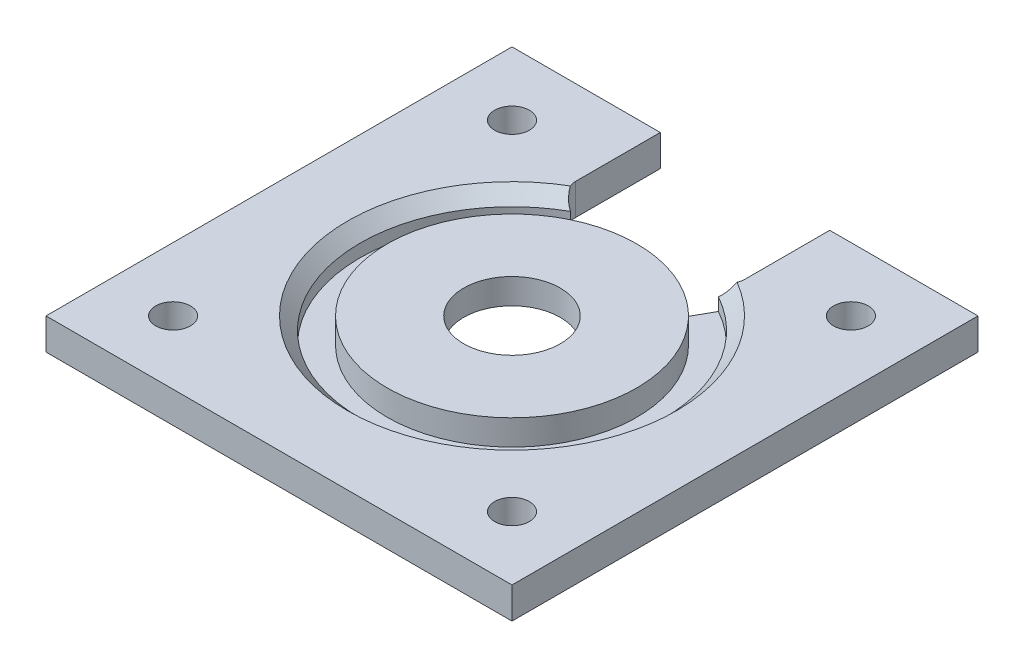
ISO-10303-21;
HEADER;
FILE_DESCRIPTION(('STEP AP214'),'2;1');
FILE_NAME('part.step','',(''),(''),'','','');
FILE_SCHEMA(('AUTOMOTIVE_DESIGN { 1 0 10303 214 1 1 1 1 }'));
ENDSEC;
DATA;
#1=APPLICATION_CONTEXT('core data for automotive mechanical design processes');
#2=APPLICATION_PROTOCOL_DEFINITION('international standard','automotive_design',2000,#1);
#3=PRODUCT_CONTEXT('',#1,'mechanical');
#4=PRODUCT('Part','Part','',(#3));
#5=PRODUCT_RELATED_PRODUCT_CATEGORY('part','',(#4));
#6=PRODUCT_DEFINITION_FORMATION('','',#4);
#7=PRODUCT_DEFINITION_CONTEXT('part definition',#1,'design');
#8=PRODUCT_DEFINITION('design','',#6,#7);
#9=PRODUCT_DEFINITION_SHAPE('','',#8);
#10=(LENGTH_UNIT() NAMED_UNIT(*) SI_UNIT(.MILLI.,.METRE.));
#11=(NAMED_UNIT(*) PLANE_ANGLE_UNIT() SI_UNIT($,.RADIAN.));
#12=(NAMED_UNIT(*) SI_UNIT($,.STERADIAN.) SOLID_ANGLE_UNIT());
#13=UNCERTAINTY_MEASURE_WITH_UNIT(LENGTH_MEASURE(1.E-05),#10,'distance_accuracy_value','');
#14=(GEOMETRIC_REPRESENTATION_CONTEXT(3) GLOBAL_UNCERTAINTY_ASSIGNED_CONTEXT((#13)) GLOBAL_UNIT_ASSIGNED_CONTEXT((#10,
#11,#12)) REPRESENTATION_CONTEXT('',''));
#15=CARTESIAN_POINT('',(0.,0.,0.));
#16=DIRECTION('',(0.,0.,1.));
#17=DIRECTION('',(1.,0.,0.));
#18=AXIS2_PLACEMENT_3D('',#15,#16,#17);
#19=CARTESIAN_POINT('',(5.8,-0.7,0.));
#20=DIRECTION('',(0.,-1.,0.));
#21=DIRECTION('',(0.,0.,-1.));
#22=AXIS2_PLACEMENT_3D('',#19,#20,#21);
#23=PLANE('',#22);
#24=CARTESIAN_POINT('',(-5.7,-0.7,0.));
#25=DIRECTION('',(0.,-1.,0.));
#26=DIRECTION('',(0.,0.,-1.));
#27=AXIS2_PLACEMENT_3D('',#24,#25,#26);
#28=CIRCLE('',#27,11.5);
#29=CARTESIAN_POINT('',(-5.7,-0.7,-11.5));
#30=VERTEX_POINT('',#29);
#31=EDGE_CURVE('E257',#30,#30,#28,.T.);
#32=ORIENTED_EDGE('',*,*,#31,.F.);
#33=EDGE_LOOP('',(#32));
#34=FACE_BOUND('',#33,.T.);
#35=CARTESIAN_POINT('',(14.3,-0.7,-20.));
#36=DIRECTION('',(0.,-1.,0.));
#37=DIRECTION('',(0.,0.,-1.));
#38=AXIS2_PLACEMENT_3D('',#35,#36,#37);
#39=CIRCLE('',#38,2.05);
#40=CARTESIAN_POINT('',(14.3,-0.7,-22.05));
#41=VERTEX_POINT('',#40);
#42=EDGE_CURVE('E204',#41,#41,#39,.T.);
#43=ORIENTED_EDGE('',*,*,#42,.F.);
#44=EDGE_LOOP('',(#43));
#45=FACE_BOUND('',#44,.T.);
#46=CARTESIAN_POINT('',(-25.7,-0.7,-20.));
#47=DIRECTION('',(0.,-1.,0.));
#48=DIRECTION('',(0.,0.,-1.));
#49=AXIS2_PLACEMENT_3D('',#46,#47,#48);
#50=CIRCLE('',#49,2.05);
#51=CARTESIAN_POINT('',(-25.7,-0.7,-22.05));
#52=VERTEX_POINT('',#51);
#53=EDGE_CURVE('E207',#52,#52,#50,.T.);
#54=ORIENTED_EDGE('',*,*,#53,.F.);
#55=EDGE_LOOP('',(#54));
#56=FACE_BOUND('',#55,.T.);
#57=CARTESIAN_POINT('',(-25.7,-0.7,20.));
#58=DIRECTION('',(0.,-1.,0.));
#59=DIRECTION('',(0.,0.,-1.));
#60=AXIS2_PLACEMENT_3D('',#57,#58,#59);
#61=CIRCLE('',#60,2.05);
#62=CARTESIAN_POINT('',(-25.7,-0.7,17.95));
#63=VERTEX_POINT('',#62);
#64=EDGE_CURVE('E210',#63,#63,#61,.T.);
#65=ORIENTED_EDGE('',*,*,#64,.F.);
#66=EDGE_LOOP('',(#65));
#67=FACE_BOUND('',#66,.T.);
#68=CARTESIAN_POINT('',(14.3,-0.7,20.));
#69=DIRECTION('',(0.,-1.,0.));
#70=DIRECTION('',(0.,0.,-1.));
#71=AXIS2_PLACEMENT_3D('',#68,#69,#70);
#72=CIRCLE('',#71,2.05);
#73=CARTESIAN_POINT('',(14.3,-0.7,17.95));
#74=VERTEX_POINT('',#73);
#75=EDGE_CURVE('E213',#74,#74,#72,.T.);
#76=ORIENTED_EDGE('',*,*,#75,.F.);
#77=EDGE_LOOP('',(#76));
#78=FACE_BOUND('',#77,.T.);
#79=DIRECTION('',(0.487252339671173,0.,-0.87326121950134));
#80=VECTOR('',#79,1.);
#81=CARTESIAN_POINT('',(1.47722696335638,-0.699999999999999,-12.8631377632547));
#82=LINE('',#81,#80);
#83=CARTESIAN_POINT('',(1.47722696335638,-0.699999999999999,-12.8631377632547));
#84=VERTEX_POINT('',#83);
#85=CARTESIAN_POINT('',(3.02425314181235,-0.699999999999999,-15.6357421351715));
#86=VERTEX_POINT('',#85);
#87=EDGE_CURVE('E151',#84,#86,#82,.T.);
#88=ORIENTED_EDGE('',*,*,#87,.T.);
#89=CARTESIAN_POINT('',(2.3,-0.699999999999999,-17.5));
#90=DIRECTION('',(0.,-1.,0.));
#91=DIRECTION('',(0.,0.,-1.));
#92=AXIS2_PLACEMENT_3D('',#89,#90,#91);
#93=CIRCLE('',#92,2.);
#94=CARTESIAN_POINT('',(4.3,-0.699999999999999,-17.5));
#95=VERTEX_POINT('',#94);
#96=EDGE_CURVE('E159',#86,#95,#93,.F.);
#97=ORIENTED_EDGE('',*,*,#96,.T.);
#98=DIRECTION('',(0.,0.,-1.));
#99=VECTOR('',#98,1.);
#100=CARTESIAN_POINT('',(4.3,-0.699999999999999,-17.5));
#101=LINE('',#100,#99);
#102=CARTESIAN_POINT('',(4.3,-0.699999999999999,-27.5));
#103=VERTEX_POINT('',#102);
#104=EDGE_CURVE('E176',#95,#103,#101,.T.);
#105=ORIENTED_EDGE('',*,*,#104,.T.);
#106=DIRECTION('',(-1.,0.,0.));
#107=VECTOR('',#106,1.);
#108=CARTESIAN_POINT('',(-33.2,-0.700000000000006,-27.5));
#109=LINE('',#108,#107);
#110=CARTESIAN_POINT('',(21.8,-0.700000000000006,-27.5));
#111=VERTEX_POINT('',#110);
#112=EDGE_CURVE('E71',#111,#103,#109,.T.);
#113=ORIENTED_EDGE('',*,*,#112,.F.);
#114=DIRECTION('',(0.,0.,-1.));
#115=VECTOR('',#114,1.);
#116=CARTESIAN_POINT('',(21.8,-0.700000000000006,-27.5));
#117=LINE('',#116,#115);
#118=CARTESIAN_POINT('',(21.8,-0.700000000000006,27.5));
#119=VERTEX_POINT('',#118);
#120=EDGE_CURVE('E229',#119,#111,#117,.T.);
#121=ORIENTED_EDGE('',*,*,#120,.F.);
#122=DIRECTION('',(1.,0.,0.));
#123=VECTOR('',#122,1.);
#124=CARTESIAN_POINT('',(-33.2,-0.700000000000006,27.5));
#125=LINE('',#124,#123);
#126=CARTESIAN_POINT('',(-33.2,-0.700000000000006,27.5));
#127=VERTEX_POINT('',#126);
#128=EDGE_CURVE('E235',#127,#119,#125,.T.);
#129=ORIENTED_EDGE('',*,*,#128,.F.);
#130=DIRECTION('',(0.,0.,1.));
#131=VECTOR('',#130,1.);
#132=CARTESIAN_POINT('',(-33.2,-0.700000000000006,-27.5));
#133=LINE('',#132,#131);
#134=CARTESIAN_POINT('',(-33.2,-0.700000000000006,-27.5));
#135=VERTEX_POINT('',#134);
#136=EDGE_CURVE('E239',#135,#127,#133,.T.);
#137=ORIENTED_EDGE('',*,*,#136,.F.);
#138=CARTESIAN_POINT('',(-15.7,-0.699999999999999,-27.5));
#139=VERTEX_POINT('',#138);
#140=EDGE_CURVE('E232',#139,#135,#109,.T.);
#141=ORIENTED_EDGE('',*,*,#140,.F.);
#142=DIRECTION('',(0.,0.,1.));
#143=VECTOR('',#142,1.);
#144=CARTESIAN_POINT('',(-15.7,-0.699999999999999,-17.5));
#145=LINE('',#144,#143);
#146=CARTESIAN_POINT('',(-15.7,-0.699999999999999,-17.5));
#147=VERTEX_POINT('',#146);
#148=EDGE_CURVE('E179',#139,#147,#145,.T.);
#149=ORIENTED_EDGE('',*,*,#148,.T.);
#150=CARTESIAN_POINT('',(-13.7,-0.699999999999999,-17.5));
#151=DIRECTION('',(0.,-1.,0.));
#152=DIRECTION('',(0.,0.,-1.));
#153=AXIS2_PLACEMENT_3D('',#150,#151,#152);
#154=CIRCLE('',#153,2.);
#155=CARTESIAN_POINT('',(-14.4242531418124,-0.699999999999999,-15.6357421351715));
#156=VERTEX_POINT('',#155);
#157=EDGE_CURVE('E169',#147,#156,#154,.F.);
#158=ORIENTED_EDGE('',*,*,#157,.T.);
#159=DIRECTION('',(0.487252339671173,0.,0.87326121950134));
#160=VECTOR('',#159,1.);
#161=CARTESIAN_POINT('',(-14.4242531418124,-0.699999999999999,-15.6357421351715));
#162=LINE('',#161,#160);
#163=CARTESIAN_POINT('',(-12.8772269633564,-0.699999999999999,-12.8631377632547));
#164=VERTEX_POINT('',#163);
#165=EDGE_CURVE('E381',#156,#164,#162,.T.);
#166=ORIENTED_EDGE('',*,*,#165,.T.);
#167=CARTESIAN_POINT('',(-5.7,-0.699999999999999,0.));
#168=DIRECTION('',(0.,-1.,0.));
#169=DIRECTION('',(0.,0.,-1.));
#170=AXIS2_PLACEMENT_3D('',#167,#168,#169);
#171=CIRCLE('',#170,14.73);
#172=EDGE_CURVE('E162',#164,#84,#171,.T.);
#173=ORIENTED_EDGE('',*,*,#172,.T.);
#174=EDGE_LOOP('',(#88,#97,#105,#113,#121,#129,#137,#141,#149,#158,#166,#173));
#175=FACE_BOUND('',#174,.T.);
#176=ADVANCED_FACE('F41',(#34,#45,#56,#67,#78,#175),#23,.T.);
#177=CARTESIAN_POINT('',(-33.2,-78.4817459305202,-27.5));
#178=DIRECTION('',(0.,0.,-1.));
#179=DIRECTION('',(-1.,0.,0.));
#180=AXIS2_PLACEMENT_3D('',#177,#178,#179);
#181=PLANE('',#180);
#182=DIRECTION('',(0.,1.,0.));
#183=VECTOR('',#182,1.);
#184=CARTESIAN_POINT('',(4.3,-24.0238075793812,-27.5));
#185=LINE('',#184,#183);
#186=CARTESIAN_POINT('',(4.3,3.,-27.5));
#187=VERTEX_POINT('',#186);
#188=EDGE_CURVE('E185',#103,#187,#185,.T.);
#189=ORIENTED_EDGE('',*,*,#188,.T.);
#190=DIRECTION('',(-1.,0.,0.));
#191=VECTOR('',#190,1.);
#192=CARTESIAN_POINT('',(-33.2,3.,-27.5));
#193=LINE('',#192,#191);
#194=CARTESIAN_POINT('',(21.8,3.,-27.5));
#195=VERTEX_POINT('',#194);
#196=EDGE_CURVE('E223',#195,#187,#193,.T.);
#197=ORIENTED_EDGE('',*,*,#196,.F.);
#198=DIRECTION('',(0.,1.,0.));
#199=VECTOR('',#198,1.);
#200=CARTESIAN_POINT('',(21.8,-78.4817459305202,-27.5));
#201=LINE('',#200,#199);
#202=EDGE_CURVE('E234',#111,#195,#201,.T.);
#203=ORIENTED_EDGE('',*,*,#202,.F.);
#204=ORIENTED_EDGE('',*,*,#112,.T.);
#205=EDGE_LOOP('',(#189,#197,#203,#204));
#206=FACE_BOUND('',#205,.T.);
#207=ADVANCED_FACE('F325',(#206),#181,.T.);
#208=CARTESIAN_POINT('',(19.7672047434114,0.,0.));
#209=DIRECTION('',(0.,1.,0.));
#210=DIRECTION('',(0.,0.,1.));
#211=AXIS2_PLACEMENT_3D('',#208,#209,#210);
#212=PLANE('',#211);
#213=DIRECTION('',(0.487252339671173,0.,-0.87326121950134));
#214=VECTOR('',#213,1.);
#215=CARTESIAN_POINT('',(1.47722696335638,0.,-12.8631377632547));
#216=LINE('',#215,#214);
#217=CARTESIAN_POINT('',(1.47722696335638,0.,-12.8631377632547));
#218=VERTEX_POINT('',#217);
#219=CARTESIAN_POINT('',(3.02425314181235,0.,-15.6357421351715));
#220=VERTEX_POINT('',#219);
#221=EDGE_CURVE('E154',#218,#220,#216,.T.);
#222=ORIENTED_EDGE('',*,*,#221,.F.);
#223=CARTESIAN_POINT('',(-5.7,0.,0.));
#224=DIRECTION('',(0.,-1.,0.));
#225=DIRECTION('',(0.,0.,-1.));
#226=AXIS2_PLACEMENT_3D('',#223,#224,#225);
#227=CIRCLE('',#226,14.73);
#228=CARTESIAN_POINT('',(-12.8772269633564,0.,-12.8631377632547));
#229=VERTEX_POINT('',#228);
#230=EDGE_CURVE('E254',#218,#229,#227,.T.);
#231=ORIENTED_EDGE('',*,*,#230,.T.);
#232=DIRECTION('',(0.487252339671173,0.,0.87326121950134));
#233=VECTOR('',#232,1.);
#234=CARTESIAN_POINT('',(-14.4242531418124,0.,-15.6357421351715));
#235=LINE('',#234,#233);
#236=CARTESIAN_POINT('',(-14.4242531418124,0.,-15.6357421351715));
#237=VERTEX_POINT('',#236);
#238=EDGE_CURVE('E163',#237,#229,#235,.T.);
#239=ORIENTED_EDGE('',*,*,#238,.F.);
#240=CARTESIAN_POINT('',(-5.7,0.,0.));
#241=DIRECTION('',(0.,1.,0.));
#242=DIRECTION('',(0.,0.,1.));
#243=AXIS2_PLACEMENT_3D('',#240,#241,#242);
#244=CIRCLE('',#243,17.905);
#245=EDGE_CURVE('E266',#220,#237,#244,.F.);
#246=ORIENTED_EDGE('',*,*,#245,.F.);
#247=EDGE_LOOP('',(#222,#231,#239,#246));
#248=FACE_BOUND('',#247,.T.);
#249=ADVANCED_FACE('F346',(#248),#212,.T.);
#250=CARTESIAN_POINT('',(-5.7,-3.54929577464788,0.));
#251=DIRECTION('',(0.,-1.,0.));
#252=DIRECTION('',(0.,0.,-1.));
#253=AXIS2_PLACEMENT_3D('',#250,#251,#252);
#254=CYLINDRICAL_SURFACE('',#253,5.7);
#255=CARTESIAN_POINT('',(-5.7,0.,0.));
#256=DIRECTION('',(0.,-1.,0.));
#257=DIRECTION('',(0.,0.,-1.));
#258=AXIS2_PLACEMENT_3D('',#255,#256,#257);
#259=CIRCLE('',#258,5.7);
#260=CARTESIAN_POINT('',(-5.7,0.,-5.7));
#261=VERTEX_POINT('',#260);
#262=EDGE_CURVE('E263',#261,#261,#259,.T.);
#263=ORIENTED_EDGE('',*,*,#262,.T.);
#264=EDGE_LOOP('',(#263));
#265=FACE_BOUND('',#264,.T.);
#266=CARTESIAN_POINT('',(-5.7,3.,0.));
#267=DIRECTION('',(0.,-1.,0.));
#268=DIRECTION('',(0.,0.,-1.));
#269=AXIS2_PLACEMENT_3D('',#266,#267,#268);
#270=CIRCLE('',#269,5.7);
#271=CARTESIAN_POINT('',(-5.7,3.,-5.7));
#272=VERTEX_POINT('',#271);
#273=EDGE_CURVE('E247',#272,#272,#270,.T.);
#274=ORIENTED_EDGE('',*,*,#273,.F.);
#275=EDGE_LOOP('',(#274));
#276=FACE_BOUND('',#275,.T.);
#277=ADVANCED_FACE('F349',(#265,#276),#254,.F.);
#278=CARTESIAN_POINT('',(0.,0.,0.));
#279=DIRECTION('',(0.,-1.,0.));
#280=DIRECTION('',(0.,0.,-1.));
#281=AXIS2_PLACEMENT_3D('',#278,#279,#280);
#282=PLANE('',#281);
#283=CARTESIAN_POINT('',(-5.7,0.,0.));
#284=DIRECTION('',(0.,-1.,0.));
#285=DIRECTION('',(0.,0.,-1.));
#286=AXIS2_PLACEMENT_3D('',#283,#284,#285);
#287=CIRCLE('',#286,11.5);
#288=CARTESIAN_POINT('',(-5.7,0.,-11.5));
#289=VERTEX_POINT('',#288);
#290=EDGE_CURVE('E260',#289,#289,#287,.T.);
#291=ORIENTED_EDGE('',*,*,#290,.T.);
#292=EDGE_LOOP('',(#291));
#293=FACE_BOUND('',#292,.T.);
#294=ORIENTED_EDGE('',*,*,#262,.F.);
#295=EDGE_LOOP('',(#294));
#296=FACE_BOUND('',#295,.T.);
#297=ADVANCED_FACE('F356',(#293,#296),#282,.T.);
#298=CARTESIAN_POINT('',(-5.7,-3.54929577464788,0.));
#299=DIRECTION('',(0.,-1.,0.));
#300=DIRECTION('',(0.,0.,-1.));
#301=AXIS2_PLACEMENT_3D('',#298,#299,#300);
#302=CYLINDRICAL_SURFACE('',#301,11.5);
#303=ORIENTED_EDGE('',*,*,#31,.T.);
#304=EDGE_LOOP('',(#303));
#305=FACE_BOUND('',#304,.T.);
#306=ORIENTED_EDGE('',*,*,#290,.F.);
#307=EDGE_LOOP('',(#306));
#308=FACE_BOUND('',#307,.T.);
#309=ADVANCED_FACE('F344',(#305,#308),#302,.F.);
#310=CARTESIAN_POINT('',(-5.7,-3.54929577464788,0.));
#311=DIRECTION('',(0.,-1.,0.));
#312=DIRECTION('',(0.,0.,-1.));
#313=AXIS2_PLACEMENT_3D('',#310,#311,#312);
#314=CYLINDRICAL_SURFACE('',#313,14.73);
#315=CARTESIAN_POINT('',(-5.7,3.,0.));
#316=DIRECTION('',(0.,-1.,0.));
#317=DIRECTION('',(0.,0.,-1.));
#318=AXIS2_PLACEMENT_3D('',#315,#316,#317);
#319=CIRCLE('',#318,14.73);
#320=CARTESIAN_POINT('',(-5.7,3.,-14.73));
#321=VERTEX_POINT('',#320);
#322=EDGE_CURVE('E251',#321,#321,#319,.T.);
#323=ORIENTED_EDGE('',*,*,#322,.T.);
#324=EDGE_LOOP('',(#323));
#325=FACE_BOUND('',#324,.T.);
#326=ORIENTED_EDGE('',*,*,#230,.F.);
#327=DIRECTION('',(0.,1.,0.));
#328=VECTOR('',#327,1.);
#329=CARTESIAN_POINT('',(1.47722696335638,-18.3674193512483,-12.8631377632547));
#330=LINE('',#329,#328);
#331=EDGE_CURVE('E371',#84,#218,#330,.T.);
#332=ORIENTED_EDGE('',*,*,#331,.F.);
#333=ORIENTED_EDGE('',*,*,#172,.F.);
#334=DIRECTION('',(0.,1.,0.));
#335=VECTOR('',#334,1.);
#336=CARTESIAN_POINT('',(-12.8772269633564,-18.3674193512483,-12.8631377632547));
#337=LINE('',#336,#335);
#338=EDGE_CURVE('E373',#164,#229,#337,.T.);
#339=ORIENTED_EDGE('',*,*,#338,.T.);
#340=EDGE_LOOP('',(#326,#332,#333,#339));
#341=FACE_BOUND('',#340,.T.);
#342=ADVANCED_FACE('F340',(#325,#341),#314,.T.);
#343=CARTESIAN_POINT('',(9.03,3.,0.));
#344=DIRECTION('',(0.,1.,0.));
#345=DIRECTION('',(0.,0.,1.));
#346=AXIS2_PLACEMENT_3D('',#343,#344,#345);
#347=PLANE('',#346);
#348=ORIENTED_EDGE('',*,*,#273,.T.);
#349=EDGE_LOOP('',(#348));
#350=FACE_BOUND('',#349,.T.);
#351=ORIENTED_EDGE('',*,*,#322,.F.);
#352=EDGE_LOOP('',(#351));
#353=FACE_BOUND('',#352,.T.);
#354=ADVANCED_FACE('F336',(#350,#353),#347,.T.);
#355=CARTESIAN_POINT('',(21.8,-78.4817459305202,-27.5));
#356=DIRECTION('',(1.,0.,0.));
#357=DIRECTION('',(0.,0.,-1.));
#358=AXIS2_PLACEMENT_3D('',#355,#356,#357);
#359=PLANE('',#358);
#360=DIRECTION('',(0.,1.,0.));
#361=VECTOR('',#360,1.);
#362=CARTESIAN_POINT('',(21.8,-78.4817459305202,27.5));
#363=LINE('',#362,#361);
#364=CARTESIAN_POINT('',(21.8,3.,27.5));
#365=VERTEX_POINT('',#364);
#366=EDGE_CURVE('E238',#119,#365,#363,.T.);
#367=ORIENTED_EDGE('',*,*,#366,.F.);
#368=ORIENTED_EDGE('',*,*,#120,.T.);
#369=ORIENTED_EDGE('',*,*,#202,.T.);
#370=DIRECTION('',(0.,0.,-1.));
#371=VECTOR('',#370,1.);
#372=CARTESIAN_POINT('',(21.8,3.,27.5));
#373=LINE('',#372,#371);
#374=EDGE_CURVE('E226',#365,#195,#373,.T.);
#375=ORIENTED_EDGE('',*,*,#374,.F.);
#376=EDGE_LOOP('',(#367,#368,#369,#375));
#377=FACE_BOUND('',#376,.T.);
#378=ADVANCED_FACE('F332',(#377),#359,.T.);
#379=CARTESIAN_POINT('',(-33.2,-78.4817459305202,27.5));
#380=DIRECTION('',(0.,0.,1.));
#381=DIRECTION('',(1.,0.,0.));
#382=AXIS2_PLACEMENT_3D('',#379,#380,#381);
#383=PLANE('',#382);
#384=DIRECTION('',(0.,1.,0.));
#385=VECTOR('',#384,1.);
#386=CARTESIAN_POINT('',(-33.2,-78.4817459305202,27.5));
#387=LINE('',#386,#385);
#388=CARTESIAN_POINT('',(-33.2,3.,27.5));
#389=VERTEX_POINT('',#388);
#390=EDGE_CURVE('E242',#127,#389,#387,.T.);
#391=ORIENTED_EDGE('',*,*,#390,.F.);
#392=ORIENTED_EDGE('',*,*,#128,.T.);
#393=ORIENTED_EDGE('',*,*,#366,.T.);
#394=DIRECTION('',(1.,0.,0.));
#395=VECTOR('',#394,1.);
#396=CARTESIAN_POINT('',(-33.2,3.,27.5));
#397=LINE('',#396,#395);
#398=EDGE_CURVE('E216',#389,#365,#397,.T.);
#399=ORIENTED_EDGE('',*,*,#398,.F.);
#400=EDGE_LOOP('',(#391,#392,#393,#399));
#401=FACE_BOUND('',#400,.T.);
#402=ADVANCED_FACE('F328',(#401),#383,.T.);
#403=CARTESIAN_POINT('',(-33.2,-78.4817459305202,-27.5));
#404=DIRECTION('',(-1.,0.,0.));
#405=DIRECTION('',(0.,0.,1.));
#406=AXIS2_PLACEMENT_3D('',#403,#404,#405);
#407=PLANE('',#406);
#408=DIRECTION('',(0.,1.,0.));
#409=VECTOR('',#408,1.);
#410=CARTESIAN_POINT('',(-33.2,-78.4817459305202,-27.5));
#411=LINE('',#410,#409);
#412=CARTESIAN_POINT('',(-33.2,3.,-27.5));
#413=VERTEX_POINT('',#412);
#414=EDGE_CURVE('E231',#135,#413,#411,.T.);
#415=ORIENTED_EDGE('',*,*,#414,.F.);
#416=ORIENTED_EDGE('',*,*,#136,.T.);
#417=ORIENTED_EDGE('',*,*,#390,.T.);
#418=DIRECTION('',(0.,0.,1.));
#419=VECTOR('',#418,1.);
#420=CARTESIAN_POINT('',(-33.2,3.,27.5));
#421=LINE('',#420,#419);
#422=EDGE_CURVE('E219',#413,#389,#421,.T.);
#423=ORIENTED_EDGE('',*,*,#422,.F.);
#424=EDGE_LOOP('',(#415,#416,#417,#423));
#425=FACE_BOUND('',#424,.T.);
#426=ADVANCED_FACE('F323',(#425),#407,.T.);
#427=DIRECTION('',(0.,1.,0.));
#428=VECTOR('',#427,1.);
#429=CARTESIAN_POINT('',(-15.7,-24.0238075793812,-27.5));
#430=LINE('',#429,#428);
#431=CARTESIAN_POINT('',(-15.7,3.,-27.5));
#432=VERTEX_POINT('',#431);
#433=EDGE_CURVE('E182',#139,#432,#430,.T.);
#434=ORIENTED_EDGE('',*,*,#433,.F.);
#435=ORIENTED_EDGE('',*,*,#140,.T.);
#436=ORIENTED_EDGE('',*,*,#414,.T.);
#437=EDGE_CURVE('E222',#432,#413,#193,.T.);
#438=ORIENTED_EDGE('',*,*,#437,.F.);
#439=EDGE_LOOP('',(#434,#435,#436,#438));
#440=FACE_BOUND('',#439,.T.);
#441=ADVANCED_FACE('F319',(#440),#181,.T.);
#442=CARTESIAN_POINT('',(-5.7,80.7817459305202,0.));
#443=DIRECTION('',(0.,-1.,0.));
#444=DIRECTION('',(0.,0.,-1.));
#445=AXIS2_PLACEMENT_3D('',#442,#443,#444);
#446=CYLINDRICAL_SURFACE('',#445,17.905);
#447=DIRECTION('',(0.,1.,0.));
#448=VECTOR('',#447,1.);
#449=CARTESIAN_POINT('',(-14.4242531418124,1.15,-15.6357421351715));
#450=LINE('',#449,#448);
#451=CARTESIAN_POINT('',(-14.4242531418124,1.5,-15.6357421351715));
#452=VERTEX_POINT('',#451);
#453=EDGE_CURVE('E189',#452,#237,#450,.F.);
#454=ORIENTED_EDGE('',*,*,#453,.F.);
#455=CARTESIAN_POINT('',(-5.7,1.5,0.));
#456=DIRECTION('',(0.,1.,0.));
#457=DIRECTION('',(0.,0.,1.));
#458=AXIS2_PLACEMENT_3D('',#455,#456,#457);
#459=CIRCLE('',#458,17.905);
#460=CARTESIAN_POINT('',(3.02425314181235,1.5,-15.6357421351715));
#461=VERTEX_POINT('',#460);
#462=EDGE_CURVE('E269',#452,#461,#459,.T.);
#463=ORIENTED_EDGE('',*,*,#462,.T.);
#464=DIRECTION('',(0.,1.,0.));
#465=VECTOR('',#464,1.);
#466=CARTESIAN_POINT('',(3.02425314181235,1.15,-15.6357421351715));
#467=LINE('',#466,#465);
#468=EDGE_CURVE('E63',#220,#461,#467,.T.);
#469=ORIENTED_EDGE('',*,*,#468,.F.);
#470=ORIENTED_EDGE('',*,*,#245,.T.);
#471=EDGE_LOOP('',(#454,#463,#469,#470));
#472=FACE_BOUND('',#471,.T.);
#473=ADVANCED_FACE('F315',(#472),#446,.F.);
#474=CARTESIAN_POINT('',(9.03,3.,0.));
#475=DIRECTION('',(0.,1.,0.));
#476=DIRECTION('',(0.,0.,1.));
#477=AXIS2_PLACEMENT_3D('',#474,#475,#476);
#478=PLANE('',#477);
#479=DIRECTION('',(0.,0.,1.));
#480=VECTOR('',#479,1.);
#481=CARTESIAN_POINT('',(-15.7,3.,-17.5));
#482=LINE('',#481,#480);
#483=CARTESIAN_POINT('',(-15.7,3.,-17.5));
#484=VERTEX_POINT('',#483);
#485=EDGE_CURVE('E389',#432,#484,#482,.T.);
#486=ORIENTED_EDGE('',*,*,#485,.F.);
#487=ORIENTED_EDGE('',*,*,#437,.T.);
#488=ORIENTED_EDGE('',*,*,#422,.T.);
#489=ORIENTED_EDGE('',*,*,#398,.T.);
#490=ORIENTED_EDGE('',*,*,#374,.T.);
#491=ORIENTED_EDGE('',*,*,#196,.T.);
#492=DIRECTION('',(0.,0.,-1.));
#493=VECTOR('',#492,1.);
#494=CARTESIAN_POINT('',(4.3,3.,-17.5));
#495=LINE('',#494,#493);
#496=CARTESIAN_POINT('',(4.3,3.,-17.5));
#497=VERTEX_POINT('',#496);
#498=EDGE_CURVE('E392',#497,#187,#495,.T.);
#499=ORIENTED_EDGE('',*,*,#498,.F.);
#500=CARTESIAN_POINT('',(2.3,3.,-17.5));
#501=DIRECTION('',(0.,1.,0.));
#502=DIRECTION('',(0.,0.,-1.));
#503=AXIS2_PLACEMENT_3D('',#500,#501,#502);
#504=CIRCLE('',#503,2.);
#505=CARTESIAN_POINT('',(4.14302534284806,3.,-16.723303414698));
#506=VERTEX_POINT('',#505);
#507=EDGE_CURVE('E386',#506,#497,#504,.T.);
#508=ORIENTED_EDGE('',*,*,#507,.F.);
#509=CARTESIAN_POINT('',(-5.7,3.,0.));
#510=DIRECTION('',(0.,1.,0.));
#511=DIRECTION('',(0.,0.,1.));
#512=AXIS2_PLACEMENT_3D('',#509,#510,#511);
#513=CIRCLE('',#512,19.405);
#514=CARTESIAN_POINT('',(-15.5430253428481,3.,-16.723303414698));
#515=VERTEX_POINT('',#514);
#516=EDGE_CURVE('E272',#506,#515,#513,.F.);
#517=ORIENTED_EDGE('',*,*,#516,.T.);
#518=CARTESIAN_POINT('',(-13.7,3.,-17.5));
#519=DIRECTION('',(0.,1.,0.));
#520=DIRECTION('',(0.,0.,1.));
#521=AXIS2_PLACEMENT_3D('',#518,#519,#520);
#522=CIRCLE('',#521,2.);
#523=EDGE_CURVE('E387',#484,#515,#522,.T.);
#524=ORIENTED_EDGE('',*,*,#523,.F.);
#525=EDGE_LOOP('',(#486,#487,#488,#489,#490,#491,#499,#508,#517,#524));
#526=FACE_BOUND('',#525,.T.);
#527=CARTESIAN_POINT('',(14.3,3.,20.));
#528=DIRECTION('',(0.,1.,0.));
#529=DIRECTION('',(0.,0.,1.));
#530=AXIS2_PLACEMENT_3D('',#527,#528,#529);
#531=CIRCLE('',#530,2.05);
#532=CARTESIAN_POINT('',(14.3,3.,22.05));
#533=VERTEX_POINT('',#532);
#534=EDGE_CURVE('E192',#533,#533,#531,.T.);
#535=ORIENTED_EDGE('',*,*,#534,.F.);
#536=EDGE_LOOP('',(#535));
#537=FACE_BOUND('',#536,.T.);
#538=CARTESIAN_POINT('',(-25.7,3.,20.));
#539=DIRECTION('',(0.,1.,0.));
#540=DIRECTION('',(0.,0.,1.));
#541=AXIS2_PLACEMENT_3D('',#538,#539,#540);
#542=CIRCLE('',#541,2.05);
#543=CARTESIAN_POINT('',(-25.7,3.,22.05));
#544=VERTEX_POINT('',#543);
#545=EDGE_CURVE('E197',#544,#544,#542,.T.);
#546=ORIENTED_EDGE('',*,*,#545,.F.);
#547=EDGE_LOOP('',(#546));
#548=FACE_BOUND('',#547,.T.);
#549=CARTESIAN_POINT('',(-25.7,3.,-20.));
#550=DIRECTION('',(0.,1.,0.));
#551=DIRECTION('',(0.,0.,1.));
#552=AXIS2_PLACEMENT_3D('',#549,#550,#551);
#553=CIRCLE('',#552,2.05);
#554=CARTESIAN_POINT('',(-25.7,3.,-17.95));
#555=VERTEX_POINT('',#554);
#556=EDGE_CURVE('E193',#555,#555,#553,.T.);
#557=ORIENTED_EDGE('',*,*,#556,.F.);
#558=EDGE_LOOP('',(#557));
#559=FACE_BOUND('',#558,.T.);
#560=CARTESIAN_POINT('',(14.3,3.,-20.));
#561=DIRECTION('',(0.,1.,0.));
#562=DIRECTION('',(0.,0.,1.));
#563=AXIS2_PLACEMENT_3D('',#560,#561,#562);
#564=CIRCLE('',#563,2.05);
#565=CARTESIAN_POINT('',(14.3,3.,-17.95));
#566=VERTEX_POINT('',#565);
#567=EDGE_CURVE('E196',#566,#566,#564,.T.);
#568=ORIENTED_EDGE('',*,*,#567,.F.);
#569=EDGE_LOOP('',(#568));
#570=FACE_BOUND('',#569,.T.);
#571=ADVANCED_FACE('F311',(#526,#537,#548,#559,#570),#478,.T.);
#572=CARTESIAN_POINT('',(14.3,-7.,-20.));
#573=DIRECTION('',(0.,1.,0.));
#574=DIRECTION('',(0.,0.,1.));
#575=AXIS2_PLACEMENT_3D('',#572,#573,#574);
#576=CYLINDRICAL_SURFACE('',#575,2.05);
#577=ORIENTED_EDGE('',*,*,#42,.T.);
#578=EDGE_LOOP('',(#577));
#579=FACE_BOUND('',#578,.T.);
#580=ORIENTED_EDGE('',*,*,#567,.T.);
#581=EDGE_LOOP('',(#580));
#582=FACE_BOUND('',#581,.T.);
#583=ADVANCED_FACE('F300',(#579,#582),#576,.F.);
#584=CARTESIAN_POINT('',(-25.7,-7.,-20.));
#585=DIRECTION('',(0.,1.,0.));
#586=DIRECTION('',(0.,0.,1.));
#587=AXIS2_PLACEMENT_3D('',#584,#585,#586);
#588=CYLINDRICAL_SURFACE('',#587,2.05);
#589=ORIENTED_EDGE('',*,*,#53,.T.);
#590=EDGE_LOOP('',(#589));
#591=FACE_BOUND('',#590,.T.);
#592=ORIENTED_EDGE('',*,*,#556,.T.);
#593=EDGE_LOOP('',(#592));
#594=FACE_BOUND('',#593,.T.);
#595=ADVANCED_FACE('F296',(#591,#594),#588,.F.);
#596=CARTESIAN_POINT('',(-25.7,-7.,20.));
#597=DIRECTION('',(0.,1.,0.));
#598=DIRECTION('',(0.,0.,1.));
#599=AXIS2_PLACEMENT_3D('',#596,#597,#598);
#600=CYLINDRICAL_SURFACE('',#599,2.05);
#601=ORIENTED_EDGE('',*,*,#64,.T.);
#602=EDGE_LOOP('',(#601));
#603=FACE_BOUND('',#602,.T.);
#604=ORIENTED_EDGE('',*,*,#545,.T.);
#605=EDGE_LOOP('',(#604));
#606=FACE_BOUND('',#605,.T.);
#607=ADVANCED_FACE('F299',(#603,#606),#600,.F.);
#608=CARTESIAN_POINT('',(14.3,-7.,20.));
#609=DIRECTION('',(0.,1.,0.));
#610=DIRECTION('',(0.,0.,1.));
#611=AXIS2_PLACEMENT_3D('',#608,#609,#610);
#612=CYLINDRICAL_SURFACE('',#611,2.05);
#613=ORIENTED_EDGE('',*,*,#75,.T.);
#614=EDGE_LOOP('',(#613));
#615=FACE_BOUND('',#614,.T.);
#616=ORIENTED_EDGE('',*,*,#534,.T.);
#617=EDGE_LOOP('',(#616));
#618=FACE_BOUND('',#617,.T.);
#619=ADVANCED_FACE('F304',(#615,#618),#612,.F.);
#620=CARTESIAN_POINT('',(-5.7,1.5,0.));
#621=DIRECTION('',(0.,1.,0.));
#622=DIRECTION('',(0.,0.,1.));
#623=AXIS2_PLACEMENT_3D('',#620,#621,#622);
#624=CONICAL_SURFACE('',#623,17.905,0.785398163397445);
#625=CARTESIAN_POINT('',(-15.5431036971935,3.00019999999999,-16.7234893681401));
#626=CARTESIAN_POINT('',(-15.5119627656634,2.92076718309331,-16.6496391221675));
#627=CARTESIAN_POINT('',(-15.4765524986618,2.84101356897954,-16.5779366033512));
#628=CARTESIAN_POINT('',(-15.3974294554267,2.68137797584411,-16.4392750994361));
#629=CARTESIAN_POINT('',(-15.3537102774605,2.6014959452484,-16.3723198269064));
#630=CARTESIAN_POINT('',(-15.2595324915487,2.44437345131397,-16.2454383901253));
#631=CARTESIAN_POINT('',(-15.2092856744007,2.36711952753536,-16.18537202168));
#632=CARTESIAN_POINT('',(-15.1013405597412,2.2137400563682,-16.0708614204415));
#633=CARTESIAN_POINT('',(-15.0436454790281,2.1376140375844,-16.0164147787305));
#634=CARTESIAN_POINT('',(-14.9026955884628,1.96497624066359,-15.8986699810459));
#635=CARTESIAN_POINT('',(-14.8169118764252,1.86904736368084,-15.8374721000871));
#636=CARTESIAN_POINT('',(-14.6780265660011,1.72816088246329,-15.7545950937989));
#637=CARTESIAN_POINT('',(-14.6295629091407,1.68130639743561,-15.728267516902));
#638=CARTESIAN_POINT('',(-14.5292964331202,1.58922873655484,-15.6791827202022));
#639=CARTESIAN_POINT('',(-14.4774904646101,1.54400716379933,-15.6564289392878));
#640=CARTESIAN_POINT('',(-14.4240111401957,1.4998,-15.6356481370534));
#641=B_SPLINE_CURVE_WITH_KNOTS('',3,(#625,#626,#627,#628,#629,#630,#631,#632,#633,#634,#635,
#636,#637,#638,#639,#640),.UNSPECIFIED.,.F.,.F.,(4,2,2,2,2,2,2,4),(0.,0.338420357416818,
0.677102521054456,1.00671646029041,1.33618851726559,1.76247513433482,1.97942165435268,
2.1965756690357),.UNSPECIFIED.);
#642=EDGE_CURVE('E11',#515,#452,#641,.T.);
#643=ORIENTED_EDGE('',*,*,#642,.F.);
#644=ORIENTED_EDGE('',*,*,#516,.F.);
#645=CARTESIAN_POINT('',(3.02401114019571,1.4998,-15.6356481370534));
#646=CARTESIAN_POINT('',(3.08729860372554,1.55212452455173,-15.6602480207882));
#647=CARTESIAN_POINT('',(3.14825993981369,1.60587133264933,-15.6876080401612));
#648=CARTESIAN_POINT('',(3.26549751500073,1.71555326252561,-15.7472434553113));
#649=CARTESIAN_POINT('',(3.3217792705066,1.77148569008291,-15.7795129329084));
#650=CARTESIAN_POINT('',(3.42869887362874,1.88387828520588,-15.8477366155383));
#651=CARTESIAN_POINT('',(3.47942691101558,1.94030566791308,-15.8836044755767));
#652=CARTESIAN_POINT('',(3.57654562435789,2.05436711676389,-15.9591500624264));
#653=CARTESIAN_POINT('',(3.62293461111863,2.11200164225029,-15.9988292609098));
#654=CARTESIAN_POINT('',(3.7183653213085,2.23730556569666,-16.0882054575466));
#655=CARTESIAN_POINT('',(3.76666444050665,2.30511917491845,-16.1384939406608));
#656=CARTESIAN_POINT('',(3.85738461692055,2.44141798790673,-16.2432762568911));
#657=CARTESIAN_POINT('',(3.8998054570981,2.50990321637087,-16.2977702451676));
#658=CARTESIAN_POINT('',(3.97961355388005,2.64878561637631,-16.411942912865));
#659=CARTESIAN_POINT('',(4.01685677091606,2.71918945892888,-16.47171419796));
#660=CARTESIAN_POINT('',(4.08487638906064,2.8598786572987,-16.5949299415023));
#661=CARTESIAN_POINT('',(4.11565406939806,2.93016403381987,-16.6583736701695));
#662=CARTESIAN_POINT('',(4.14310369719354,3.00019999999999,-16.7234893681401));
#663=B_SPLINE_CURVE_WITH_KNOTS('',3,(#645,#646,#647,#648,#649,#650,#651,#652,#653,#654,#655,
#656,#657,#658,#659,#660,#661,#662),.UNSPECIFIED.,.F.,.F.,(4,2,2,2,2,2,2,2,4),(0.,
0.256996517686836,0.513685654457409,0.765254289533807,1.01692045631654,1.30842696516091,
1.59994423416204,1.89840835125479,2.19681336045458),.UNSPECIFIED.);
#664=EDGE_CURVE('E56',#461,#506,#663,.T.);
#665=ORIENTED_EDGE('',*,*,#664,.F.);
#666=ORIENTED_EDGE('',*,*,#462,.F.);
#667=EDGE_LOOP('',(#643,#644,#665,#666));
#668=FACE_BOUND('',#667,.T.);
#669=ADVANCED_FACE('F44',(#668),#624,.F.);
#670=CARTESIAN_POINT('',(4.3,-24.0238075793812,-17.5));
#671=DIRECTION('',(1.,0.,0.));
#672=DIRECTION('',(0.,0.,-1.));
#673=AXIS2_PLACEMENT_3D('',#670,#671,#672);
#674=PLANE('',#673);
#675=DIRECTION('',(0.,1.,0.));
#676=VECTOR('',#675,1.);
#677=CARTESIAN_POINT('',(4.3,-24.0238075793812,-17.5));
#678=LINE('',#677,#676);
#679=EDGE_CURVE('E168',#95,#497,#678,.T.);
#680=ORIENTED_EDGE('',*,*,#679,.T.);
#681=ORIENTED_EDGE('',*,*,#498,.T.);
#682=ORIENTED_EDGE('',*,*,#188,.F.);
#683=ORIENTED_EDGE('',*,*,#104,.F.);
#684=EDGE_LOOP('',(#680,#681,#682,#683));
#685=FACE_BOUND('',#684,.T.);
#686=ADVANCED_FACE('F291',(#685),#674,.F.);
#687=CARTESIAN_POINT('',(-15.7,-24.0238075793812,-17.5));
#688=DIRECTION('',(-1.,0.,0.));
#689=DIRECTION('',(0.,0.,1.));
#690=AXIS2_PLACEMENT_3D('',#687,#688,#689);
#691=PLANE('',#690);
#692=ORIENTED_EDGE('',*,*,#433,.T.);
#693=ORIENTED_EDGE('',*,*,#485,.T.);
#694=DIRECTION('',(0.,1.,0.));
#695=VECTOR('',#694,1.);
#696=CARTESIAN_POINT('',(-15.7,-24.0238075793812,-17.5));
#697=LINE('',#696,#695);
#698=EDGE_CURVE('E173',#147,#484,#697,.T.);
#699=ORIENTED_EDGE('',*,*,#698,.F.);
#700=ORIENTED_EDGE('',*,*,#148,.F.);
#701=EDGE_LOOP('',(#692,#693,#699,#700));
#702=FACE_BOUND('',#701,.T.);
#703=ADVANCED_FACE('F287',(#702),#691,.F.);
#704=CARTESIAN_POINT('',(-13.7,-24.0238075793812,-17.5));
#705=DIRECTION('',(0.,1.,0.));
#706=DIRECTION('',(0.,0.,1.));
#707=AXIS2_PLACEMENT_3D('',#704,#705,#706);
#708=CYLINDRICAL_SURFACE('',#707,2.);
#709=ORIENTED_EDGE('',*,*,#453,.T.);
#710=DIRECTION('',(0.,1.,0.));
#711=VECTOR('',#710,1.);
#712=CARTESIAN_POINT('',(-14.4242531418124,-18.3674193512483,-15.6357421351715));
#713=LINE('',#712,#711);
#714=EDGE_CURVE('E156',#156,#237,#713,.T.);
#715=ORIENTED_EDGE('',*,*,#714,.F.);
#716=ORIENTED_EDGE('',*,*,#157,.F.);
#717=ORIENTED_EDGE('',*,*,#698,.T.);
#718=ORIENTED_EDGE('',*,*,#523,.T.);
#719=ORIENTED_EDGE('',*,*,#642,.T.);
#720=EDGE_LOOP('',(#709,#715,#716,#717,#718,#719));
#721=FACE_BOUND('',#720,.T.);
#722=ADVANCED_FACE('F282',(#721),#708,.F.);
#723=CARTESIAN_POINT('',(2.3,-24.0238075793812,-17.5));
#724=DIRECTION('',(0.,1.,0.));
#725=DIRECTION('',(0.,0.,1.));
#726=AXIS2_PLACEMENT_3D('',#723,#724,#725);
#727=CYLINDRICAL_SURFACE('',#726,2.);
#728=ORIENTED_EDGE('',*,*,#96,.F.);
#729=DIRECTION('',(0.,1.,0.));
#730=VECTOR('',#729,1.);
#731=CARTESIAN_POINT('',(3.02425314181235,-18.3674193512483,-15.6357421351715));
#732=LINE('',#731,#730);
#733=EDGE_CURVE('E148',#86,#220,#732,.T.);
#734=ORIENTED_EDGE('',*,*,#733,.T.);
#735=ORIENTED_EDGE('',*,*,#468,.T.);
#736=ORIENTED_EDGE('',*,*,#664,.T.);
#737=ORIENTED_EDGE('',*,*,#507,.T.);
#738=ORIENTED_EDGE('',*,*,#679,.F.);
#739=EDGE_LOOP('',(#728,#734,#735,#736,#737,#738));
#740=FACE_BOUND('',#739,.T.);
#741=ADVANCED_FACE('F166',(#740),#727,.F.);
#742=CARTESIAN_POINT('',(1.47722696335638,-18.3674193512483,-12.8631377632547));
#743=DIRECTION('',(0.87326121950134,0.,0.487252339671173));
#744=DIRECTION('',(0.487252339671173,0.,-0.87326121950134));
#745=AXIS2_PLACEMENT_3D('',#742,#743,#744);
#746=PLANE('',#745);
#747=ORIENTED_EDGE('',*,*,#331,.T.);
#748=ORIENTED_EDGE('',*,*,#221,.T.);
#749=ORIENTED_EDGE('',*,*,#733,.F.);
#750=ORIENTED_EDGE('',*,*,#87,.F.);
#751=EDGE_LOOP('',(#747,#748,#749,#750));
#752=FACE_BOUND('',#751,.T.);
#753=ADVANCED_FACE('F150',(#752),#746,.F.);
#754=CARTESIAN_POINT('',(-14.4242531418124,-18.3674193512483,-15.6357421351715));
#755=DIRECTION('',(-0.87326121950134,0.,0.487252339671173));
#756=DIRECTION('',(0.487252339671173,0.,0.87326121950134));
#757=AXIS2_PLACEMENT_3D('',#754,#755,#756);
#758=PLANE('',#757);
#759=ORIENTED_EDGE('',*,*,#714,.T.);
#760=ORIENTED_EDGE('',*,*,#238,.T.);
#761=ORIENTED_EDGE('',*,*,#338,.F.);
#762=ORIENTED_EDGE('',*,*,#165,.F.);
#763=EDGE_LOOP('',(#759,#760,#761,#762));
#764=FACE_BOUND('',#763,.T.);
#765=ADVANCED_FACE('F417',(#764),#758,.F.);
#766=CLOSED_SHELL('',(#176,#207,#249,#277,#297,#309,#342,#354,#378,#402,#426,#441,#473,#571,
#583,#595,#607,#619,#669,#686,#703,#722,#741,#753,#765));
#767=MANIFOLD_SOLID_BREP('B2',#766);
#768=ADVANCED_BREP_SHAPE_REPRESENTATION('',(#18,#767),#14);
#769=SHAPE_DEFINITION_REPRESENTATION(#9,#768);
ENDSEC;
END-ISO-10303-21;
